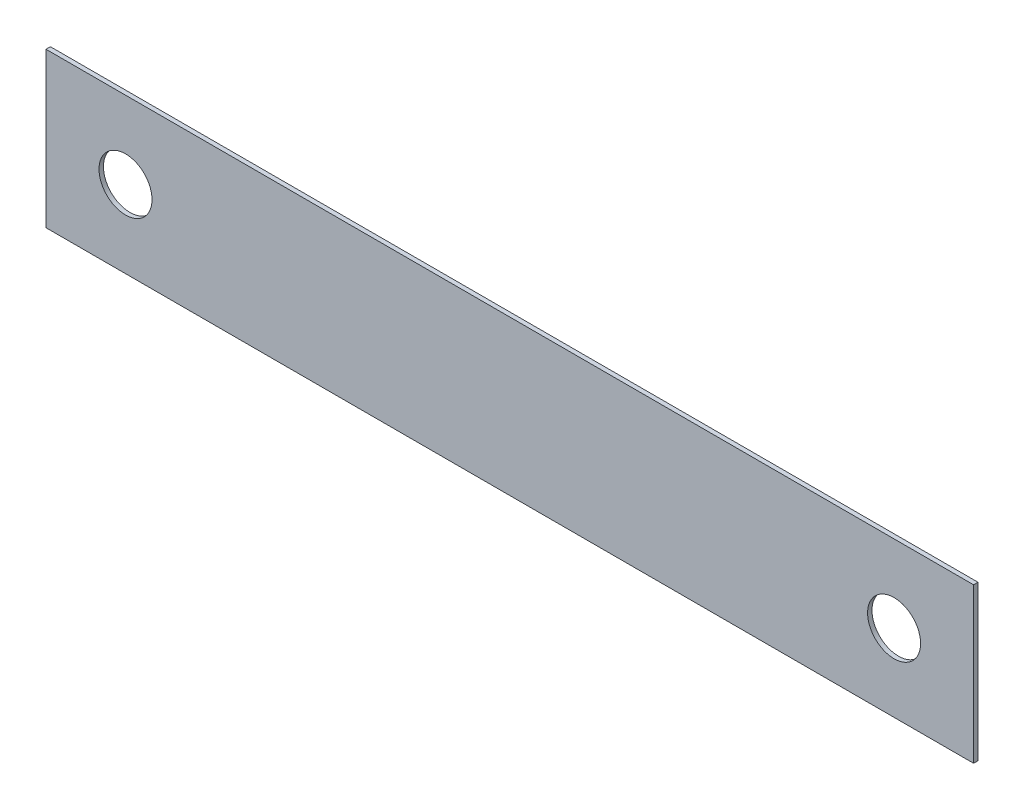
ISO-10303-21;
HEADER;
FILE_DESCRIPTION(('STEP AP214'),'2;1');
FILE_NAME('part.step','',(''),(''),'','','');
FILE_SCHEMA(('AUTOMOTIVE_DESIGN { 1 0 10303 214 1 1 1 1 }'));
ENDSEC;
DATA;
#1=APPLICATION_CONTEXT('core data for automotive mechanical design processes');
#2=APPLICATION_PROTOCOL_DEFINITION('international standard','automotive_design',2000,#1);
#3=PRODUCT_CONTEXT('',#1,'mechanical');
#4=PRODUCT('Part','Part','',(#3));
#5=PRODUCT_RELATED_PRODUCT_CATEGORY('part','',(#4));
#6=PRODUCT_DEFINITION_FORMATION('','',#4);
#7=PRODUCT_DEFINITION_CONTEXT('part definition',#1,'design');
#8=PRODUCT_DEFINITION('design','',#6,#7);
#9=PRODUCT_DEFINITION_SHAPE('','',#8);
#10=(LENGTH_UNIT() NAMED_UNIT(*) SI_UNIT(.MILLI.,.METRE.));
#11=(NAMED_UNIT(*) PLANE_ANGLE_UNIT() SI_UNIT($,.RADIAN.));
#12=(NAMED_UNIT(*) SI_UNIT($,.STERADIAN.) SOLID_ANGLE_UNIT());
#13=UNCERTAINTY_MEASURE_WITH_UNIT(LENGTH_MEASURE(1.E-05),#10,'distance_accuracy_value','');
#14=(GEOMETRIC_REPRESENTATION_CONTEXT(3) GLOBAL_UNCERTAINTY_ASSIGNED_CONTEXT((#13)) GLOBAL_UNIT_ASSIGNED_CONTEXT((#10,
#11,#12)) REPRESENTATION_CONTEXT('',''));
#15=CARTESIAN_POINT('',(0.,0.,0.));
#16=DIRECTION('',(0.,0.,1.));
#17=DIRECTION('',(1.,0.,0.));
#18=AXIS2_PLACEMENT_3D('',#15,#16,#17);
#19=CARTESIAN_POINT('',(0.,0.,0.5));
#20=DIRECTION('',(0.,0.,-1.));
#21=DIRECTION('',(-1.,0.,0.));
#22=AXIS2_PLACEMENT_3D('',#19,#20,#21);
#23=PLANE('',#22);
#24=CARTESIAN_POINT('',(8.99999999999999,8.75000000000001,0.5));
#25=DIRECTION('',(0.,0.,1.));
#26=DIRECTION('',(1.,0.,0.));
#27=AXIS2_PLACEMENT_3D('',#24,#25,#26);
#28=CIRCLE('',#27,3.);
#29=CARTESIAN_POINT('',(12.,8.75000000000001,0.5));
#30=VERTEX_POINT('',#29);
#31=EDGE_CURVE('E101',#30,#30,#28,.T.);
#32=ORIENTED_EDGE('',*,*,#31,.F.);
#33=EDGE_LOOP('',(#32));
#34=FACE_BOUND('',#33,.T.);
#35=DIRECTION('',(0.,-1.,0.));
#36=VECTOR('',#35,1.);
#37=CARTESIAN_POINT('',(0.,0.,0.5));
#38=LINE('',#37,#36);
#39=CARTESIAN_POINT('',(0.,17.5,0.5));
#40=VERTEX_POINT('',#39);
#41=CARTESIAN_POINT('',(0.,0.,0.5));
#42=VERTEX_POINT('',#41);
#43=EDGE_CURVE('E86',#40,#42,#38,.T.);
#44=ORIENTED_EDGE('',*,*,#43,.T.);
#45=DIRECTION('',(1.,0.,0.));
#46=VECTOR('',#45,1.);
#47=CARTESIAN_POINT('',(0.,0.,0.5));
#48=LINE('',#47,#46);
#49=CARTESIAN_POINT('',(105.,0.,0.5));
#50=VERTEX_POINT('',#49);
#51=EDGE_CURVE('E81',#42,#50,#48,.T.);
#52=ORIENTED_EDGE('',*,*,#51,.T.);
#53=DIRECTION('',(0.,1.,0.));
#54=VECTOR('',#53,1.);
#55=CARTESIAN_POINT('',(105.,0.,0.5));
#56=LINE('',#55,#54);
#57=CARTESIAN_POINT('',(105.,17.5,0.5));
#58=VERTEX_POINT('',#57);
#59=EDGE_CURVE('E84',#50,#58,#56,.T.);
#60=ORIENTED_EDGE('',*,*,#59,.T.);
#61=DIRECTION('',(-1.,0.,0.));
#62=VECTOR('',#61,1.);
#63=CARTESIAN_POINT('',(0.,17.5,0.5));
#64=LINE('',#63,#62);
#65=EDGE_CURVE('E51',#58,#40,#64,.T.);
#66=ORIENTED_EDGE('',*,*,#65,.T.);
#67=EDGE_LOOP('',(#44,#52,#60,#66));
#68=FACE_BOUND('',#67,.T.);
#69=CARTESIAN_POINT('',(96.,8.75000000000002,0.5));
#70=DIRECTION('',(0.,0.,1.));
#71=DIRECTION('',(1.,0.,0.));
#72=AXIS2_PLACEMENT_3D('',#69,#70,#71);
#73=CIRCLE('',#72,3.00000000000001);
#74=CARTESIAN_POINT('',(99.,8.75000000000002,0.5));
#75=VERTEX_POINT('',#74);
#76=EDGE_CURVE('E116',#75,#75,#73,.T.);
#77=ORIENTED_EDGE('',*,*,#76,.F.);
#78=EDGE_LOOP('',(#77));
#79=FACE_BOUND('',#78,.T.);
#80=ADVANCED_FACE('F34',(#34,#68,#79),#23,.F.);
#81=CARTESIAN_POINT('',(0.,0.,0.));
#82=DIRECTION('',(0.,0.,-1.));
#83=DIRECTION('',(-1.,0.,0.));
#84=AXIS2_PLACEMENT_3D('',#81,#82,#83);
#85=PLANE('',#84);
#86=CARTESIAN_POINT('',(8.99999999999999,8.75000000000001,0.));
#87=DIRECTION('',(0.,0.,1.));
#88=DIRECTION('',(1.,0.,0.));
#89=AXIS2_PLACEMENT_3D('',#86,#87,#88);
#90=CIRCLE('',#89,3.);
#91=CARTESIAN_POINT('',(12.,8.75000000000001,0.));
#92=VERTEX_POINT('',#91);
#93=EDGE_CURVE('E113',#92,#92,#90,.T.);
#94=ORIENTED_EDGE('',*,*,#93,.T.);
#95=EDGE_LOOP('',(#94));
#96=FACE_BOUND('',#95,.T.);
#97=DIRECTION('',(0.,-1.,0.));
#98=VECTOR('',#97,1.);
#99=CARTESIAN_POINT('',(0.,0.,0.));
#100=LINE('',#99,#98);
#101=CARTESIAN_POINT('',(0.,17.5,0.));
#102=VERTEX_POINT('',#101);
#103=CARTESIAN_POINT('',(0.,0.,0.));
#104=VERTEX_POINT('',#103);
#105=EDGE_CURVE('E98',#102,#104,#100,.T.);
#106=ORIENTED_EDGE('',*,*,#105,.F.);
#107=DIRECTION('',(-1.,0.,0.));
#108=VECTOR('',#107,1.);
#109=CARTESIAN_POINT('',(0.,17.5,0.));
#110=LINE('',#109,#108);
#111=CARTESIAN_POINT('',(105.,17.5,0.));
#112=VERTEX_POINT('',#111);
#113=EDGE_CURVE('E74',#112,#102,#110,.T.);
#114=ORIENTED_EDGE('',*,*,#113,.F.);
#115=DIRECTION('',(0.,1.,0.));
#116=VECTOR('',#115,1.);
#117=CARTESIAN_POINT('',(105.,0.,0.));
#118=LINE('',#117,#116);
#119=CARTESIAN_POINT('',(105.,0.,0.));
#120=VERTEX_POINT('',#119);
#121=EDGE_CURVE('E68',#120,#112,#118,.T.);
#122=ORIENTED_EDGE('',*,*,#121,.F.);
#123=DIRECTION('',(1.,0.,0.));
#124=VECTOR('',#123,1.);
#125=CARTESIAN_POINT('',(0.,0.,0.));
#126=LINE('',#125,#124);
#127=EDGE_CURVE('E90',#104,#120,#126,.T.);
#128=ORIENTED_EDGE('',*,*,#127,.F.);
#129=EDGE_LOOP('',(#106,#114,#122,#128));
#130=FACE_BOUND('',#129,.T.);
#131=CARTESIAN_POINT('',(96.,8.75000000000002,0.));
#132=DIRECTION('',(0.,0.,1.));
#133=DIRECTION('',(1.,0.,0.));
#134=AXIS2_PLACEMENT_3D('',#131,#132,#133);
#135=CIRCLE('',#134,3.00000000000001);
#136=CARTESIAN_POINT('',(99.,8.75000000000002,0.));
#137=VERTEX_POINT('',#136);
#138=EDGE_CURVE('E119',#137,#137,#135,.T.);
#139=ORIENTED_EDGE('',*,*,#138,.T.);
#140=EDGE_LOOP('',(#139));
#141=FACE_BOUND('',#140,.T.);
#142=ADVANCED_FACE('F109',(#96,#130,#141),#85,.T.);
#143=CARTESIAN_POINT('',(0.,0.,0.5));
#144=DIRECTION('',(1.,0.,0.));
#145=DIRECTION('',(0.,0.,-1.));
#146=AXIS2_PLACEMENT_3D('',#143,#144,#145);
#147=PLANE('',#146);
#148=ORIENTED_EDGE('',*,*,#105,.T.);
#149=DIRECTION('',(0.,0.,-1.));
#150=VECTOR('',#149,1.);
#151=CARTESIAN_POINT('',(0.,0.,0.5));
#152=LINE('',#151,#150);
#153=EDGE_CURVE('E11',#42,#104,#152,.T.);
#154=ORIENTED_EDGE('',*,*,#153,.F.);
#155=ORIENTED_EDGE('',*,*,#43,.F.);
#156=DIRECTION('',(0.,0.,-1.));
#157=VECTOR('',#156,1.);
#158=CARTESIAN_POINT('',(0.,17.5,0.5));
#159=LINE('',#158,#157);
#160=EDGE_CURVE('E94',#40,#102,#159,.T.);
#161=ORIENTED_EDGE('',*,*,#160,.T.);
#162=EDGE_LOOP('',(#148,#154,#155,#161));
#163=FACE_BOUND('',#162,.T.);
#164=ADVANCED_FACE('F36',(#163),#147,.F.);
#165=CARTESIAN_POINT('',(0.,0.,0.5));
#166=DIRECTION('',(0.,1.,0.));
#167=DIRECTION('',(0.,0.,1.));
#168=AXIS2_PLACEMENT_3D('',#165,#166,#167);
#169=PLANE('',#168);
#170=ORIENTED_EDGE('',*,*,#127,.T.);
#171=DIRECTION('',(0.,0.,-1.));
#172=VECTOR('',#171,1.);
#173=CARTESIAN_POINT('',(105.,0.,0.5));
#174=LINE('',#173,#172);
#175=EDGE_CURVE('E43',#50,#120,#174,.T.);
#176=ORIENTED_EDGE('',*,*,#175,.F.);
#177=ORIENTED_EDGE('',*,*,#51,.F.);
#178=ORIENTED_EDGE('',*,*,#153,.T.);
#179=EDGE_LOOP('',(#170,#176,#177,#178));
#180=FACE_BOUND('',#179,.T.);
#181=ADVANCED_FACE('F89',(#180),#169,.F.);
#182=CARTESIAN_POINT('',(105.,0.,0.5));
#183=DIRECTION('',(-1.,0.,0.));
#184=DIRECTION('',(0.,0.,1.));
#185=AXIS2_PLACEMENT_3D('',#182,#183,#184);
#186=PLANE('',#185);
#187=ORIENTED_EDGE('',*,*,#121,.T.);
#188=DIRECTION('',(0.,0.,-1.));
#189=VECTOR('',#188,1.);
#190=CARTESIAN_POINT('',(105.,17.5,0.5));
#191=LINE('',#190,#189);
#192=EDGE_CURVE('E91',#58,#112,#191,.T.);
#193=ORIENTED_EDGE('',*,*,#192,.F.);
#194=ORIENTED_EDGE('',*,*,#59,.F.);
#195=ORIENTED_EDGE('',*,*,#175,.T.);
#196=EDGE_LOOP('',(#187,#193,#194,#195));
#197=FACE_BOUND('',#196,.T.);
#198=ADVANCED_FACE('F92',(#197),#186,.F.);
#199=CARTESIAN_POINT('',(0.,17.5,0.5));
#200=DIRECTION('',(0.,-1.,0.));
#201=DIRECTION('',(0.,0.,-1.));
#202=AXIS2_PLACEMENT_3D('',#199,#200,#201);
#203=PLANE('',#202);
#204=ORIENTED_EDGE('',*,*,#113,.T.);
#205=ORIENTED_EDGE('',*,*,#160,.F.);
#206=ORIENTED_EDGE('',*,*,#65,.F.);
#207=ORIENTED_EDGE('',*,*,#192,.T.);
#208=EDGE_LOOP('',(#204,#205,#206,#207));
#209=FACE_BOUND('',#208,.T.);
#210=ADVANCED_FACE('F106',(#209),#203,.F.);
#211=CARTESIAN_POINT('',(8.99999999999999,8.75000000000001,0.5));
#212=DIRECTION('',(0.,0.,-1.));
#213=DIRECTION('',(-1.,0.,0.));
#214=AXIS2_PLACEMENT_3D('',#211,#212,#213);
#215=CYLINDRICAL_SURFACE('',#214,3.);
#216=ORIENTED_EDGE('',*,*,#31,.T.);
#217=EDGE_LOOP('',(#216));
#218=FACE_BOUND('',#217,.T.);
#219=ORIENTED_EDGE('',*,*,#93,.F.);
#220=EDGE_LOOP('',(#219));
#221=FACE_BOUND('',#220,.T.);
#222=ADVANCED_FACE('F137',(#218,#221),#215,.F.);
#223=CARTESIAN_POINT('',(96.,8.75000000000002,0.5));
#224=DIRECTION('',(0.,0.,-1.));
#225=DIRECTION('',(-1.,0.,0.));
#226=AXIS2_PLACEMENT_3D('',#223,#224,#225);
#227=CYLINDRICAL_SURFACE('',#226,3.00000000000001);
#228=ORIENTED_EDGE('',*,*,#76,.T.);
#229=EDGE_LOOP('',(#228));
#230=FACE_BOUND('',#229,.T.);
#231=ORIENTED_EDGE('',*,*,#138,.F.);
#232=EDGE_LOOP('',(#231));
#233=FACE_BOUND('',#232,.T.);
#234=ADVANCED_FACE('F125',(#230,#233),#227,.F.);
#235=CLOSED_SHELL('',(#80,#142,#164,#181,#198,#210,#222,#234));
#236=MANIFOLD_SOLID_BREP('B2',#235);
#237=ADVANCED_BREP_SHAPE_REPRESENTATION('',(#18,#236),#14);
#238=SHAPE_DEFINITION_REPRESENTATION(#9,#237);
ENDSEC;
END-ISO-10303-21;
